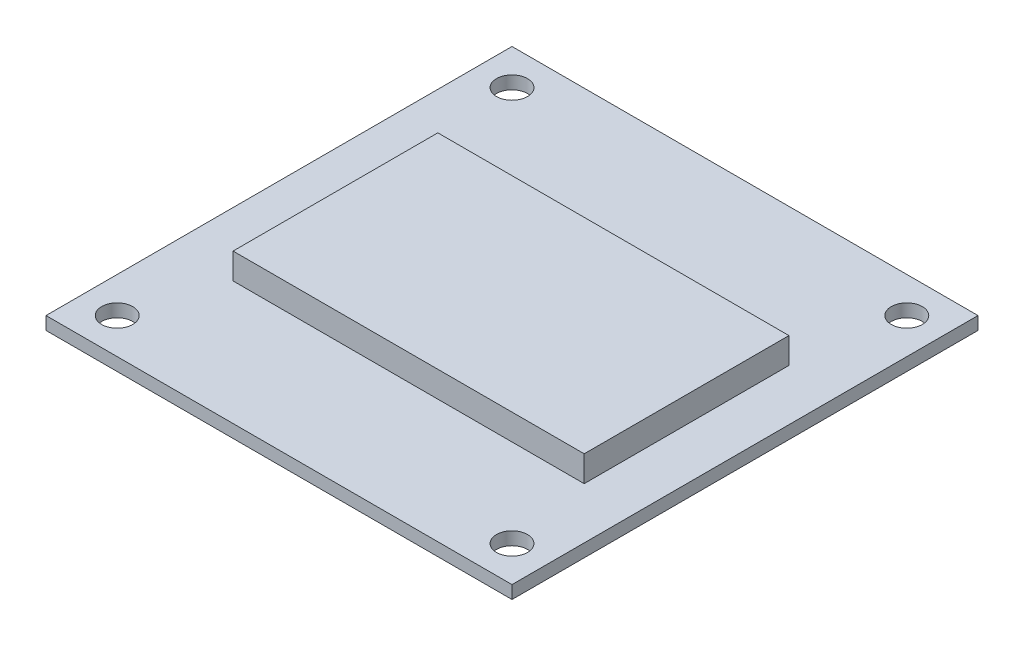
ISO-10303-21;
HEADER;
FILE_DESCRIPTION(('STEP AP214'),'2;1');
FILE_NAME('part.step','',(''),(''),'','','');
FILE_SCHEMA(('AUTOMOTIVE_DESIGN { 1 0 10303 214 1 1 1 1 }'));
ENDSEC;
DATA;
#1=APPLICATION_CONTEXT('core data for automotive mechanical design processes');
#2=APPLICATION_PROTOCOL_DEFINITION('international standard','automotive_design',2000,#1);
#3=PRODUCT_CONTEXT('',#1,'mechanical');
#4=PRODUCT('Part','Part','',(#3));
#5=PRODUCT_RELATED_PRODUCT_CATEGORY('part','',(#4));
#6=PRODUCT_DEFINITION_FORMATION('','',#4);
#7=PRODUCT_DEFINITION_CONTEXT('part definition',#1,'design');
#8=PRODUCT_DEFINITION('design','',#6,#7);
#9=PRODUCT_DEFINITION_SHAPE('','',#8);
#10=(LENGTH_UNIT() NAMED_UNIT(*) SI_UNIT(.MILLI.,.METRE.));
#11=(NAMED_UNIT(*) PLANE_ANGLE_UNIT() SI_UNIT($,.RADIAN.));
#12=(NAMED_UNIT(*) SI_UNIT($,.STERADIAN.) SOLID_ANGLE_UNIT());
#13=UNCERTAINTY_MEASURE_WITH_UNIT(LENGTH_MEASURE(1.E-05),#10,'distance_accuracy_value','');
#14=(GEOMETRIC_REPRESENTATION_CONTEXT(3) GLOBAL_UNCERTAINTY_ASSIGNED_CONTEXT((#13)) GLOBAL_UNIT_ASSIGNED_CONTEXT((#10,
#11,#12)) REPRESENTATION_CONTEXT('',''));
#15=CARTESIAN_POINT('',(0.,0.,0.));
#16=DIRECTION('',(0.,0.,1.));
#17=DIRECTION('',(1.,0.,0.));
#18=AXIS2_PLACEMENT_3D('',#15,#16,#17);
#19=CARTESIAN_POINT('',(0.,1.,0.));
#20=DIRECTION('',(0.,-1.,0.));
#21=DIRECTION('',(0.,0.,-1.));
#22=AXIS2_PLACEMENT_3D('',#19,#20,#21);
#23=PLANE('',#22);
#24=DIRECTION('',(0.,0.,1.));
#25=VECTOR('',#24,1.);
#26=CARTESIAN_POINT('',(0.,1.,0.));
#27=LINE('',#26,#25);
#28=CARTESIAN_POINT('',(0.,1.,-36.));
#29=VERTEX_POINT('',#28);
#30=CARTESIAN_POINT('',(0.,1.,0.));
#31=VERTEX_POINT('',#30);
#32=EDGE_CURVE('E151',#29,#31,#27,.T.);
#33=ORIENTED_EDGE('',*,*,#32,.T.);
#34=DIRECTION('',(1.,0.,0.));
#35=VECTOR('',#34,1.);
#36=CARTESIAN_POINT('',(0.,1.,0.));
#37=LINE('',#36,#35);
#38=CARTESIAN_POINT('',(36.,1.,0.));
#39=VERTEX_POINT('',#38);
#40=EDGE_CURVE('E154',#31,#39,#37,.T.);
#41=ORIENTED_EDGE('',*,*,#40,.T.);
#42=DIRECTION('',(0.,0.,-1.));
#43=VECTOR('',#42,1.);
#44=CARTESIAN_POINT('',(36.,1.,0.));
#45=LINE('',#44,#43);
#46=CARTESIAN_POINT('',(36.,1.,-36.));
#47=VERTEX_POINT('',#46);
#48=EDGE_CURVE('E157',#39,#47,#45,.T.);
#49=ORIENTED_EDGE('',*,*,#48,.T.);
#50=DIRECTION('',(-1.,0.,0.));
#51=VECTOR('',#50,1.);
#52=CARTESIAN_POINT('',(0.,1.,-36.));
#53=LINE('',#52,#51);
#54=EDGE_CURVE('E159',#47,#29,#53,.T.);
#55=ORIENTED_EDGE('',*,*,#54,.T.);
#56=EDGE_LOOP('',(#33,#41,#49,#55));
#57=FACE_BOUND('',#56,.T.);
#58=CARTESIAN_POINT('',(33.25,1.,-2.75));
#59=DIRECTION('',(0.,1.,0.));
#60=DIRECTION('',(0.,0.,1.));
#61=AXIS2_PLACEMENT_3D('',#58,#59,#60);
#62=CIRCLE('',#61,1.19999999999999);
#63=CARTESIAN_POINT('',(33.25,1.,-1.55000000000001));
#64=VERTEX_POINT('',#63);
#65=EDGE_CURVE('E144',#64,#64,#62,.T.);
#66=ORIENTED_EDGE('',*,*,#65,.F.);
#67=EDGE_LOOP('',(#66));
#68=FACE_BOUND('',#67,.T.);
#69=CARTESIAN_POINT('',(33.25,1.,-33.25));
#70=DIRECTION('',(0.,1.,0.));
#71=DIRECTION('',(0.,0.,1.));
#72=AXIS2_PLACEMENT_3D('',#69,#70,#71);
#73=CIRCLE('',#72,1.19999999999999);
#74=CARTESIAN_POINT('',(33.25,1.,-32.05));
#75=VERTEX_POINT('',#74);
#76=EDGE_CURVE('E138',#75,#75,#73,.T.);
#77=ORIENTED_EDGE('',*,*,#76,.F.);
#78=EDGE_LOOP('',(#77));
#79=FACE_BOUND('',#78,.T.);
#80=CARTESIAN_POINT('',(2.75,1.,-33.25));
#81=DIRECTION('',(0.,1.,0.));
#82=DIRECTION('',(0.,0.,1.));
#83=AXIS2_PLACEMENT_3D('',#80,#81,#82);
#84=CIRCLE('',#83,1.19999999999999);
#85=CARTESIAN_POINT('',(2.75,1.,-32.05));
#86=VERTEX_POINT('',#85);
#87=EDGE_CURVE('E132',#86,#86,#84,.T.);
#88=ORIENTED_EDGE('',*,*,#87,.F.);
#89=EDGE_LOOP('',(#88));
#90=FACE_BOUND('',#89,.T.);
#91=CARTESIAN_POINT('',(2.75,1.,-2.75));
#92=DIRECTION('',(0.,1.,0.));
#93=DIRECTION('',(0.,0.,1.));
#94=AXIS2_PLACEMENT_3D('',#91,#92,#93);
#95=CIRCLE('',#94,1.19999999999999);
#96=CARTESIAN_POINT('',(2.75,1.,-1.55000000000001));
#97=VERTEX_POINT('',#96);
#98=EDGE_CURVE('E121',#97,#97,#95,.T.);
#99=ORIENTED_EDGE('',*,*,#98,.F.);
#100=EDGE_LOOP('',(#99));
#101=FACE_BOUND('',#100,.T.);
#102=DIRECTION('',(0.,0.,1.));
#103=VECTOR('',#102,1.);
#104=CARTESIAN_POINT('',(4.91250896668305,1.,-25.3572144787313));
#105=LINE('',#104,#103);
#106=CARTESIAN_POINT('',(4.91250896668305,1.,-25.3572144787313));
#107=VERTEX_POINT('',#106);
#108=CARTESIAN_POINT('',(4.91250896668305,1.,-9.53948937012683));
#109=VERTEX_POINT('',#108);
#110=EDGE_CURVE('E120',#107,#109,#105,.T.);
#111=ORIENTED_EDGE('',*,*,#110,.F.);
#112=DIRECTION('',(-1.,0.,0.));
#113=VECTOR('',#112,1.);
#114=CARTESIAN_POINT('',(4.91250896668305,1.,-25.3572144787313));
#115=LINE('',#114,#113);
#116=CARTESIAN_POINT('',(32.0379265727126,1.,-25.3572144787313));
#117=VERTEX_POINT('',#116);
#118=EDGE_CURVE('E117',#117,#107,#115,.T.);
#119=ORIENTED_EDGE('',*,*,#118,.F.);
#120=DIRECTION('',(0.,0.,-1.));
#121=VECTOR('',#120,1.);
#122=CARTESIAN_POINT('',(32.0379265727126,1.,-25.3572144787313));
#123=LINE('',#122,#121);
#124=CARTESIAN_POINT('',(32.0379265727126,1.,-9.53948937012683));
#125=VERTEX_POINT('',#124);
#126=EDGE_CURVE('E55',#125,#117,#123,.T.);
#127=ORIENTED_EDGE('',*,*,#126,.F.);
#128=DIRECTION('',(1.,0.,0.));
#129=VECTOR('',#128,1.);
#130=CARTESIAN_POINT('',(4.91250896668305,1.,-9.53948937012683));
#131=LINE('',#130,#129);
#132=EDGE_CURVE('E50',#109,#125,#131,.T.);
#133=ORIENTED_EDGE('',*,*,#132,.F.);
#134=EDGE_LOOP('',(#111,#119,#127,#133));
#135=FACE_BOUND('',#134,.T.);
#136=ADVANCED_FACE('F35',(#57,#68,#79,#90,#101,#135),#23,.F.);
#137=CARTESIAN_POINT('',(0.,1.,0.));
#138=DIRECTION('',(1.,0.,0.));
#139=DIRECTION('',(0.,0.,-1.));
#140=AXIS2_PLACEMENT_3D('',#137,#138,#139);
#141=PLANE('',#140);
#142=DIRECTION('',(0.,0.,1.));
#143=VECTOR('',#142,1.);
#144=CARTESIAN_POINT('',(0.,0.,0.));
#145=LINE('',#144,#143);
#146=CARTESIAN_POINT('',(0.,0.,-36.));
#147=VERTEX_POINT('',#146);
#148=CARTESIAN_POINT('',(0.,0.,0.));
#149=VERTEX_POINT('',#148);
#150=EDGE_CURVE('E150',#147,#149,#145,.T.);
#151=ORIENTED_EDGE('',*,*,#150,.T.);
#152=DIRECTION('',(0.,-1.,0.));
#153=VECTOR('',#152,1.);
#154=CARTESIAN_POINT('',(0.,1.,0.));
#155=LINE('',#154,#153);
#156=EDGE_CURVE('E11',#31,#149,#155,.T.);
#157=ORIENTED_EDGE('',*,*,#156,.F.);
#158=ORIENTED_EDGE('',*,*,#32,.F.);
#159=DIRECTION('',(0.,-1.,0.));
#160=VECTOR('',#159,1.);
#161=CARTESIAN_POINT('',(0.,1.,-36.));
#162=LINE('',#161,#160);
#163=EDGE_CURVE('E161',#29,#147,#162,.T.);
#164=ORIENTED_EDGE('',*,*,#163,.T.);
#165=EDGE_LOOP('',(#151,#157,#158,#164));
#166=FACE_BOUND('',#165,.T.);
#167=ADVANCED_FACE('F37',(#166),#141,.F.);
#168=CARTESIAN_POINT('',(0.,1.,0.));
#169=DIRECTION('',(0.,0.,-1.));
#170=DIRECTION('',(-1.,0.,0.));
#171=AXIS2_PLACEMENT_3D('',#168,#169,#170);
#172=PLANE('',#171);
#173=DIRECTION('',(1.,0.,0.));
#174=VECTOR('',#173,1.);
#175=CARTESIAN_POINT('',(0.,0.,0.));
#176=LINE('',#175,#174);
#177=CARTESIAN_POINT('',(36.,0.,0.));
#178=VERTEX_POINT('',#177);
#179=EDGE_CURVE('E164',#149,#178,#176,.T.);
#180=ORIENTED_EDGE('',*,*,#179,.T.);
#181=DIRECTION('',(0.,-1.,0.));
#182=VECTOR('',#181,1.);
#183=CARTESIAN_POINT('',(36.,1.,0.));
#184=LINE('',#183,#182);
#185=EDGE_CURVE('E43',#39,#178,#184,.T.);
#186=ORIENTED_EDGE('',*,*,#185,.F.);
#187=ORIENTED_EDGE('',*,*,#40,.F.);
#188=ORIENTED_EDGE('',*,*,#156,.T.);
#189=EDGE_LOOP('',(#180,#186,#187,#188));
#190=FACE_BOUND('',#189,.T.);
#191=ADVANCED_FACE('F194',(#190),#172,.F.);
#192=CARTESIAN_POINT('',(36.,1.,0.));
#193=DIRECTION('',(-1.,0.,0.));
#194=DIRECTION('',(0.,0.,1.));
#195=AXIS2_PLACEMENT_3D('',#192,#193,#194);
#196=PLANE('',#195);
#197=DIRECTION('',(0.,0.,-1.));
#198=VECTOR('',#197,1.);
#199=CARTESIAN_POINT('',(36.,0.,0.));
#200=LINE('',#199,#198);
#201=CARTESIAN_POINT('',(36.,0.,-36.));
#202=VERTEX_POINT('',#201);
#203=EDGE_CURVE('E166',#178,#202,#200,.T.);
#204=ORIENTED_EDGE('',*,*,#203,.T.);
#205=DIRECTION('',(0.,-1.,0.));
#206=VECTOR('',#205,1.);
#207=CARTESIAN_POINT('',(36.,1.,-36.));
#208=LINE('',#207,#206);
#209=EDGE_CURVE('E171',#47,#202,#208,.T.);
#210=ORIENTED_EDGE('',*,*,#209,.F.);
#211=ORIENTED_EDGE('',*,*,#48,.F.);
#212=ORIENTED_EDGE('',*,*,#185,.T.);
#213=EDGE_LOOP('',(#204,#210,#211,#212));
#214=FACE_BOUND('',#213,.T.);
#215=ADVANCED_FACE('F178',(#214),#196,.F.);
#216=CARTESIAN_POINT('',(0.,1.,-36.));
#217=DIRECTION('',(0.,0.,1.));
#218=DIRECTION('',(1.,0.,0.));
#219=AXIS2_PLACEMENT_3D('',#216,#217,#218);
#220=PLANE('',#219);
#221=DIRECTION('',(-1.,0.,0.));
#222=VECTOR('',#221,1.);
#223=CARTESIAN_POINT('',(0.,0.,-36.));
#224=LINE('',#223,#222);
#225=EDGE_CURVE('E155',#202,#147,#224,.T.);
#226=ORIENTED_EDGE('',*,*,#225,.T.);
#227=ORIENTED_EDGE('',*,*,#163,.F.);
#228=ORIENTED_EDGE('',*,*,#54,.F.);
#229=ORIENTED_EDGE('',*,*,#209,.T.);
#230=EDGE_LOOP('',(#226,#227,#228,#229));
#231=FACE_BOUND('',#230,.T.);
#232=ADVANCED_FACE('F187',(#231),#220,.F.);
#233=CARTESIAN_POINT('',(0.,0.,0.));
#234=DIRECTION('',(0.,-1.,0.));
#235=DIRECTION('',(0.,0.,-1.));
#236=AXIS2_PLACEMENT_3D('',#233,#234,#235);
#237=PLANE('',#236);
#238=CARTESIAN_POINT('',(2.75,0.,-2.75));
#239=DIRECTION('',(0.,1.,0.));
#240=DIRECTION('',(0.,0.,1.));
#241=AXIS2_PLACEMENT_3D('',#238,#239,#240);
#242=CIRCLE('',#241,1.2);
#243=CARTESIAN_POINT('',(2.75,0.,-1.55));
#244=VERTEX_POINT('',#243);
#245=EDGE_CURVE('E124',#244,#244,#242,.T.);
#246=ORIENTED_EDGE('',*,*,#245,.T.);
#247=EDGE_LOOP('',(#246));
#248=FACE_BOUND('',#247,.T.);
#249=CARTESIAN_POINT('',(2.75,0.,-33.25));
#250=DIRECTION('',(0.,1.,0.));
#251=DIRECTION('',(0.,0.,1.));
#252=AXIS2_PLACEMENT_3D('',#249,#250,#251);
#253=CIRCLE('',#252,1.2);
#254=CARTESIAN_POINT('',(2.75,0.,-32.05));
#255=VERTEX_POINT('',#254);
#256=EDGE_CURVE('E135',#255,#255,#253,.T.);
#257=ORIENTED_EDGE('',*,*,#256,.T.);
#258=EDGE_LOOP('',(#257));
#259=FACE_BOUND('',#258,.T.);
#260=CARTESIAN_POINT('',(33.25,0.,-33.25));
#261=DIRECTION('',(0.,1.,0.));
#262=DIRECTION('',(0.,0.,1.));
#263=AXIS2_PLACEMENT_3D('',#260,#261,#262);
#264=CIRCLE('',#263,1.2);
#265=CARTESIAN_POINT('',(33.25,0.,-32.05));
#266=VERTEX_POINT('',#265);
#267=EDGE_CURVE('E141',#266,#266,#264,.T.);
#268=ORIENTED_EDGE('',*,*,#267,.T.);
#269=EDGE_LOOP('',(#268));
#270=FACE_BOUND('',#269,.T.);
#271=CARTESIAN_POINT('',(33.25,0.,-2.75));
#272=DIRECTION('',(0.,1.,0.));
#273=DIRECTION('',(0.,0.,1.));
#274=AXIS2_PLACEMENT_3D('',#271,#272,#273);
#275=CIRCLE('',#274,1.2);
#276=CARTESIAN_POINT('',(33.25,0.,-1.55));
#277=VERTEX_POINT('',#276);
#278=EDGE_CURVE('E147',#277,#277,#275,.T.);
#279=ORIENTED_EDGE('',*,*,#278,.T.);
#280=EDGE_LOOP('',(#279));
#281=FACE_BOUND('',#280,.T.);
#282=ORIENTED_EDGE('',*,*,#150,.F.);
#283=ORIENTED_EDGE('',*,*,#225,.F.);
#284=ORIENTED_EDGE('',*,*,#203,.F.);
#285=ORIENTED_EDGE('',*,*,#179,.F.);
#286=EDGE_LOOP('',(#282,#283,#284,#285));
#287=FACE_BOUND('',#286,.T.);
#288=ADVANCED_FACE('F184',(#248,#259,#270,#281,#287),#237,.T.);
#289=CARTESIAN_POINT('',(33.25,1.,-2.75));
#290=DIRECTION('',(0.,1.,0.));
#291=DIRECTION('',(0.,0.,1.));
#292=AXIS2_PLACEMENT_3D('',#289,#290,#291);
#293=CYLINDRICAL_SURFACE('',#292,1.19999999999999);
#294=ORIENTED_EDGE('',*,*,#278,.F.);
#295=EDGE_LOOP('',(#294));
#296=FACE_BOUND('',#295,.T.);
#297=ORIENTED_EDGE('',*,*,#65,.T.);
#298=EDGE_LOOP('',(#297));
#299=FACE_BOUND('',#298,.T.);
#300=ADVANCED_FACE('F207',(#296,#299),#293,.F.);
#301=CARTESIAN_POINT('',(33.25,1.,-33.25));
#302=DIRECTION('',(0.,1.,0.));
#303=DIRECTION('',(0.,0.,1.));
#304=AXIS2_PLACEMENT_3D('',#301,#302,#303);
#305=CYLINDRICAL_SURFACE('',#304,1.19999999999999);
#306=ORIENTED_EDGE('',*,*,#267,.F.);
#307=EDGE_LOOP('',(#306));
#308=FACE_BOUND('',#307,.T.);
#309=ORIENTED_EDGE('',*,*,#76,.T.);
#310=EDGE_LOOP('',(#309));
#311=FACE_BOUND('',#310,.T.);
#312=ADVANCED_FACE('F227',(#308,#311),#305,.F.);
#313=CARTESIAN_POINT('',(2.75,1.,-33.25));
#314=DIRECTION('',(0.,1.,0.));
#315=DIRECTION('',(0.,0.,1.));
#316=AXIS2_PLACEMENT_3D('',#313,#314,#315);
#317=CYLINDRICAL_SURFACE('',#316,1.19999999999999);
#318=ORIENTED_EDGE('',*,*,#256,.F.);
#319=EDGE_LOOP('',(#318));
#320=FACE_BOUND('',#319,.T.);
#321=ORIENTED_EDGE('',*,*,#87,.T.);
#322=EDGE_LOOP('',(#321));
#323=FACE_BOUND('',#322,.T.);
#324=ADVANCED_FACE('F234',(#320,#323),#317,.F.);
#325=CARTESIAN_POINT('',(2.75,1.,-2.75));
#326=DIRECTION('',(0.,1.,0.));
#327=DIRECTION('',(0.,0.,1.));
#328=AXIS2_PLACEMENT_3D('',#325,#326,#327);
#329=CYLINDRICAL_SURFACE('',#328,1.19999999999999);
#330=ORIENTED_EDGE('',*,*,#245,.F.);
#331=EDGE_LOOP('',(#330));
#332=FACE_BOUND('',#331,.T.);
#333=ORIENTED_EDGE('',*,*,#98,.T.);
#334=EDGE_LOOP('',(#333));
#335=FACE_BOUND('',#334,.T.);
#336=ADVANCED_FACE('F241',(#332,#335),#329,.F.);
#337=CARTESIAN_POINT('',(4.91250896668305,3.,-25.3572144787313));
#338=DIRECTION('',(1.,0.,0.));
#339=DIRECTION('',(0.,0.,-1.));
#340=AXIS2_PLACEMENT_3D('',#337,#338,#339);
#341=PLANE('',#340);
#342=ORIENTED_EDGE('',*,*,#110,.T.);
#343=DIRECTION('',(0.,-1.,0.));
#344=VECTOR('',#343,1.);
#345=CARTESIAN_POINT('',(4.91250896668305,3.,-9.53948937012683));
#346=LINE('',#345,#344);
#347=CARTESIAN_POINT('',(4.91250896668305,3.,-9.53948937012683));
#348=VERTEX_POINT('',#347);
#349=EDGE_CURVE('E101',#348,#109,#346,.T.);
#350=ORIENTED_EDGE('',*,*,#349,.F.);
#351=DIRECTION('',(0.,0.,1.));
#352=VECTOR('',#351,1.);
#353=CARTESIAN_POINT('',(4.91250896668305,3.,-25.3572144787313));
#354=LINE('',#353,#352);
#355=CARTESIAN_POINT('',(4.91250896668305,3.,-25.3572144787313));
#356=VERTEX_POINT('',#355);
#357=EDGE_CURVE('E108',#356,#348,#354,.T.);
#358=ORIENTED_EDGE('',*,*,#357,.F.);
#359=DIRECTION('',(0.,-1.,0.));
#360=VECTOR('',#359,1.);
#361=CARTESIAN_POINT('',(4.91250896668305,3.,-25.3572144787313));
#362=LINE('',#361,#360);
#363=EDGE_CURVE('E330',#356,#107,#362,.T.);
#364=ORIENTED_EDGE('',*,*,#363,.T.);
#365=EDGE_LOOP('',(#342,#350,#358,#364));
#366=FACE_BOUND('',#365,.T.);
#367=ADVANCED_FACE('F119',(#366),#341,.F.);
#368=CARTESIAN_POINT('',(4.91250896668305,3.,-9.53948937012683));
#369=DIRECTION('',(0.,0.,-1.));
#370=DIRECTION('',(-1.,0.,0.));
#371=AXIS2_PLACEMENT_3D('',#368,#369,#370);
#372=PLANE('',#371);
#373=ORIENTED_EDGE('',*,*,#132,.T.);
#374=DIRECTION('',(0.,-1.,0.));
#375=VECTOR('',#374,1.);
#376=CARTESIAN_POINT('',(32.0379265727126,3.,-9.53948937012683));
#377=LINE('',#376,#375);
#378=CARTESIAN_POINT('',(32.0379265727126,3.,-9.53948937012683));
#379=VERTEX_POINT('',#378);
#380=EDGE_CURVE('E104',#379,#125,#377,.T.);
#381=ORIENTED_EDGE('',*,*,#380,.F.);
#382=DIRECTION('',(1.,0.,0.));
#383=VECTOR('',#382,1.);
#384=CARTESIAN_POINT('',(4.91250896668305,3.,-9.53948937012683));
#385=LINE('',#384,#383);
#386=EDGE_CURVE('E97',#348,#379,#385,.T.);
#387=ORIENTED_EDGE('',*,*,#386,.F.);
#388=ORIENTED_EDGE('',*,*,#349,.T.);
#389=EDGE_LOOP('',(#373,#381,#387,#388));
#390=FACE_BOUND('',#389,.T.);
#391=ADVANCED_FACE('F99',(#390),#372,.F.);
#392=CARTESIAN_POINT('',(32.0379265727126,3.,-25.3572144787313));
#393=DIRECTION('',(-1.,0.,0.));
#394=DIRECTION('',(0.,0.,1.));
#395=AXIS2_PLACEMENT_3D('',#392,#393,#394);
#396=PLANE('',#395);
#397=ORIENTED_EDGE('',*,*,#126,.T.);
#398=DIRECTION('',(0.,-1.,0.));
#399=VECTOR('',#398,1.);
#400=CARTESIAN_POINT('',(32.0379265727126,3.,-25.3572144787313));
#401=LINE('',#400,#399);
#402=CARTESIAN_POINT('',(32.0379265727126,3.,-25.3572144787313));
#403=VERTEX_POINT('',#402);
#404=EDGE_CURVE('E126',#403,#117,#401,.T.);
#405=ORIENTED_EDGE('',*,*,#404,.F.);
#406=DIRECTION('',(0.,0.,-1.));
#407=VECTOR('',#406,1.);
#408=CARTESIAN_POINT('',(32.0379265727126,3.,-25.3572144787313));
#409=LINE('',#408,#407);
#410=EDGE_CURVE('E107',#379,#403,#409,.T.);
#411=ORIENTED_EDGE('',*,*,#410,.F.);
#412=ORIENTED_EDGE('',*,*,#380,.T.);
#413=EDGE_LOOP('',(#397,#405,#411,#412));
#414=FACE_BOUND('',#413,.T.);
#415=ADVANCED_FACE('F263',(#414),#396,.F.);
#416=CARTESIAN_POINT('',(4.91250896668305,3.,-25.3572144787313));
#417=DIRECTION('',(0.,0.,1.));
#418=DIRECTION('',(1.,0.,0.));
#419=AXIS2_PLACEMENT_3D('',#416,#417,#418);
#420=PLANE('',#419);
#421=ORIENTED_EDGE('',*,*,#118,.T.);
#422=ORIENTED_EDGE('',*,*,#363,.F.);
#423=DIRECTION('',(-1.,0.,0.));
#424=VECTOR('',#423,1.);
#425=CARTESIAN_POINT('',(4.91250896668305,3.,-25.3572144787313));
#426=LINE('',#425,#424);
#427=EDGE_CURVE('E113',#403,#356,#426,.T.);
#428=ORIENTED_EDGE('',*,*,#427,.F.);
#429=ORIENTED_EDGE('',*,*,#404,.T.);
#430=EDGE_LOOP('',(#421,#422,#428,#429));
#431=FACE_BOUND('',#430,.T.);
#432=ADVANCED_FACE('F270',(#431),#420,.F.);
#433=CARTESIAN_POINT('',(0.,3.,0.));
#434=DIRECTION('',(0.,1.,0.));
#435=DIRECTION('',(0.,0.,1.));
#436=AXIS2_PLACEMENT_3D('',#433,#434,#435);
#437=PLANE('',#436);
#438=ORIENTED_EDGE('',*,*,#357,.T.);
#439=ORIENTED_EDGE('',*,*,#386,.T.);
#440=ORIENTED_EDGE('',*,*,#410,.T.);
#441=ORIENTED_EDGE('',*,*,#427,.T.);
#442=EDGE_LOOP('',(#438,#439,#440,#441));
#443=FACE_BOUND('',#442,.T.);
#444=ADVANCED_FACE('F111',(#443),#437,.T.);
#445=CLOSED_SHELL('',(#136,#167,#191,#215,#232,#288,#300,#312,#324,#336,#367,#391,#415,#432,#444));
#446=MANIFOLD_SOLID_BREP('B2',#445);
#447=ADVANCED_BREP_SHAPE_REPRESENTATION('',(#18,#446),#14);
#448=SHAPE_DEFINITION_REPRESENTATION(#9,#447);
ENDSEC;
END-ISO-10303-21;
